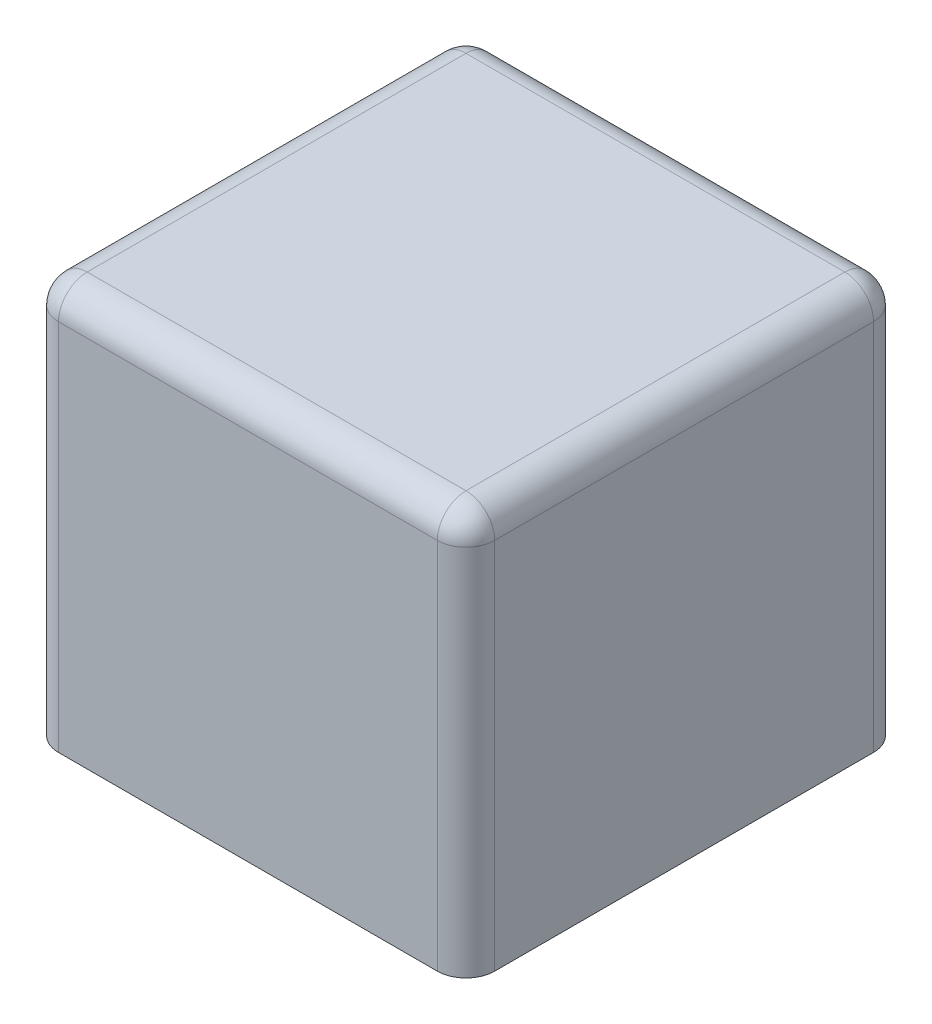
ISO-10303-21;
HEADER;
FILE_DESCRIPTION(('STEP AP214'),'2;1');
FILE_NAME('part.step','',(''),(''),'','','');
FILE_SCHEMA(('AUTOMOTIVE_DESIGN { 1 0 10303 214 1 1 1 1 }'));
ENDSEC;
DATA;
#1=APPLICATION_CONTEXT('core data for automotive mechanical design processes');
#2=APPLICATION_PROTOCOL_DEFINITION('international standard','automotive_design',2000,#1);
#3=PRODUCT_CONTEXT('',#1,'mechanical');
#4=PRODUCT('Part','Part','',(#3));
#5=PRODUCT_RELATED_PRODUCT_CATEGORY('part','',(#4));
#6=PRODUCT_DEFINITION_FORMATION('','',#4);
#7=PRODUCT_DEFINITION_CONTEXT('part definition',#1,'design');
#8=PRODUCT_DEFINITION('design','',#6,#7);
#9=PRODUCT_DEFINITION_SHAPE('','',#8);
#10=(LENGTH_UNIT() NAMED_UNIT(*) SI_UNIT(.MILLI.,.METRE.));
#11=(NAMED_UNIT(*) PLANE_ANGLE_UNIT() SI_UNIT($,.RADIAN.));
#12=(NAMED_UNIT(*) SI_UNIT($,.STERADIAN.) SOLID_ANGLE_UNIT());
#13=UNCERTAINTY_MEASURE_WITH_UNIT(LENGTH_MEASURE(1.E-05),#10,'distance_accuracy_value','');
#14=(GEOMETRIC_REPRESENTATION_CONTEXT(3) GLOBAL_UNCERTAINTY_ASSIGNED_CONTEXT((#13)) GLOBAL_UNIT_ASSIGNED_CONTEXT((#10,
#11,#12)) REPRESENTATION_CONTEXT('',''));
#15=CARTESIAN_POINT('',(0.,0.,0.));
#16=DIRECTION('',(0.,0.,1.));
#17=DIRECTION('',(1.,0.,0.));
#18=AXIS2_PLACEMENT_3D('',#15,#16,#17);
#19=CARTESIAN_POINT('',(3.8,7.,-3.8));
#20=DIRECTION('',(-1.,0.,0.));
#21=DIRECTION('',(0.,0.,1.));
#22=AXIS2_PLACEMENT_3D('',#19,#20,#21);
#23=PLANE('',#22);
#24=DIRECTION('',(0.,0.,-1.));
#25=VECTOR('',#24,1.);
#26=CARTESIAN_POINT('',(3.8,6.5,3.8));
#27=LINE('',#26,#25);
#28=CARTESIAN_POINT('',(3.8,6.5,-3.3));
#29=VERTEX_POINT('',#28);
#30=CARTESIAN_POINT('',(3.8,6.5,3.3));
#31=VERTEX_POINT('',#30);
#32=EDGE_CURVE('E261',#29,#31,#27,.F.);
#33=ORIENTED_EDGE('',*,*,#32,.T.);
#34=DIRECTION('',(0.,-1.,0.));
#35=VECTOR('',#34,1.);
#36=CARTESIAN_POINT('',(3.8,7.,3.3));
#37=LINE('',#36,#35);
#38=CARTESIAN_POINT('',(3.8,0.,3.3));
#39=VERTEX_POINT('',#38);
#40=EDGE_CURVE('E263',#31,#39,#37,.T.);
#41=ORIENTED_EDGE('',*,*,#40,.T.);
#42=DIRECTION('',(0.,0.,-1.));
#43=VECTOR('',#42,1.);
#44=CARTESIAN_POINT('',(3.8,0.,-3.8));
#45=LINE('',#44,#43);
#46=CARTESIAN_POINT('',(3.8,0.,-3.3));
#47=VERTEX_POINT('',#46);
#48=EDGE_CURVE('E198',#39,#47,#45,.T.);
#49=ORIENTED_EDGE('',*,*,#48,.T.);
#50=DIRECTION('',(0.,-1.,0.));
#51=VECTOR('',#50,1.);
#52=CARTESIAN_POINT('',(3.8,7.,-3.3));
#53=LINE('',#52,#51);
#54=EDGE_CURVE('E259',#47,#29,#53,.F.);
#55=ORIENTED_EDGE('',*,*,#54,.T.);
#56=EDGE_LOOP('',(#33,#41,#49,#55));
#57=FACE_BOUND('',#56,.T.);
#58=ADVANCED_FACE('F33',(#57),#23,.F.);
#59=CARTESIAN_POINT('',(-3.8,7.,-3.8));
#60=DIRECTION('',(0.,0.,1.));
#61=DIRECTION('',(1.,0.,0.));
#62=AXIS2_PLACEMENT_3D('',#59,#60,#61);
#63=PLANE('',#62);
#64=DIRECTION('',(-1.,0.,0.));
#65=VECTOR('',#64,1.);
#66=CARTESIAN_POINT('',(-3.8,0.,-3.8));
#67=LINE('',#66,#65);
#68=CARTESIAN_POINT('',(3.3,0.,-3.8));
#69=VERTEX_POINT('',#68);
#70=CARTESIAN_POINT('',(-3.3,0.,-3.8));
#71=VERTEX_POINT('',#70);
#72=EDGE_CURVE('E202',#69,#71,#67,.T.);
#73=ORIENTED_EDGE('',*,*,#72,.T.);
#74=DIRECTION('',(0.,-1.,0.));
#75=VECTOR('',#74,1.);
#76=CARTESIAN_POINT('',(-3.3,7.,-3.8));
#77=LINE('',#76,#75);
#78=CARTESIAN_POINT('',(-3.3,6.5,-3.8));
#79=VERTEX_POINT('',#78);
#80=EDGE_CURVE('E257',#71,#79,#77,.F.);
#81=ORIENTED_EDGE('',*,*,#80,.T.);
#82=DIRECTION('',(-1.,0.,0.));
#83=VECTOR('',#82,1.);
#84=CARTESIAN_POINT('',(3.8,6.5,-3.8));
#85=LINE('',#84,#83);
#86=CARTESIAN_POINT('',(3.3,6.5,-3.8));
#87=VERTEX_POINT('',#86);
#88=EDGE_CURVE('E254',#79,#87,#85,.F.);
#89=ORIENTED_EDGE('',*,*,#88,.T.);
#90=DIRECTION('',(0.,-1.,0.));
#91=VECTOR('',#90,1.);
#92=CARTESIAN_POINT('',(3.3,7.,-3.8));
#93=LINE('',#92,#91);
#94=EDGE_CURVE('E252',#87,#69,#93,.T.);
#95=ORIENTED_EDGE('',*,*,#94,.T.);
#96=EDGE_LOOP('',(#73,#81,#89,#95));
#97=FACE_BOUND('',#96,.T.);
#98=ADVANCED_FACE('F400',(#97),#63,.F.);
#99=CARTESIAN_POINT('',(-3.8,7.,-3.8));
#100=DIRECTION('',(1.,0.,0.));
#101=DIRECTION('',(0.,0.,-1.));
#102=AXIS2_PLACEMENT_3D('',#99,#100,#101);
#103=PLANE('',#102);
#104=DIRECTION('',(0.,0.,1.));
#105=VECTOR('',#104,1.);
#106=CARTESIAN_POINT('',(-3.8,0.,-3.8));
#107=LINE('',#106,#105);
#108=CARTESIAN_POINT('',(-3.8,0.,-3.3));
#109=VERTEX_POINT('',#108);
#110=CARTESIAN_POINT('',(-3.8,0.,3.3));
#111=VERTEX_POINT('',#110);
#112=EDGE_CURVE('E210',#109,#111,#107,.T.);
#113=ORIENTED_EDGE('',*,*,#112,.T.);
#114=DIRECTION('',(0.,-1.,0.));
#115=VECTOR('',#114,1.);
#116=CARTESIAN_POINT('',(-3.8,7.,3.3));
#117=LINE('',#116,#115);
#118=CARTESIAN_POINT('',(-3.8,6.5,3.3));
#119=VERTEX_POINT('',#118);
#120=EDGE_CURVE('E50',#111,#119,#117,.F.);
#121=ORIENTED_EDGE('',*,*,#120,.T.);
#122=DIRECTION('',(0.,0.,1.));
#123=VECTOR('',#122,1.);
#124=CARTESIAN_POINT('',(-3.8,6.5,-3.8));
#125=LINE('',#124,#123);
#126=CARTESIAN_POINT('',(-3.8,6.5,-3.3));
#127=VERTEX_POINT('',#126);
#128=EDGE_CURVE('E55',#119,#127,#125,.F.);
#129=ORIENTED_EDGE('',*,*,#128,.T.);
#130=DIRECTION('',(0.,-1.,0.));
#131=VECTOR('',#130,1.);
#132=CARTESIAN_POINT('',(-3.8,7.,-3.3));
#133=LINE('',#132,#131);
#134=EDGE_CURVE('E279',#127,#109,#133,.T.);
#135=ORIENTED_EDGE('',*,*,#134,.T.);
#136=EDGE_LOOP('',(#113,#121,#129,#135));
#137=FACE_BOUND('',#136,.T.);
#138=ADVANCED_FACE('F385',(#137),#103,.F.);
#139=CARTESIAN_POINT('',(-3.8,7.,3.8));
#140=DIRECTION('',(0.,0.,-1.));
#141=DIRECTION('',(-1.,0.,0.));
#142=AXIS2_PLACEMENT_3D('',#139,#140,#141);
#143=PLANE('',#142);
#144=DIRECTION('',(1.,0.,0.));
#145=VECTOR('',#144,1.);
#146=CARTESIAN_POINT('',(-3.8,0.,3.8));
#147=LINE('',#146,#145);
#148=CARTESIAN_POINT('',(-3.3,0.,3.8));
#149=VERTEX_POINT('',#148);
#150=CARTESIAN_POINT('',(3.3,0.,3.8));
#151=VERTEX_POINT('',#150);
#152=EDGE_CURVE('E212',#149,#151,#147,.T.);
#153=ORIENTED_EDGE('',*,*,#152,.T.);
#154=DIRECTION('',(0.,-1.,0.));
#155=VECTOR('',#154,1.);
#156=CARTESIAN_POINT('',(3.3,7.,3.8));
#157=LINE('',#156,#155);
#158=CARTESIAN_POINT('',(3.3,6.5,3.8));
#159=VERTEX_POINT('',#158);
#160=EDGE_CURVE('E277',#151,#159,#157,.F.);
#161=ORIENTED_EDGE('',*,*,#160,.T.);
#162=DIRECTION('',(1.,0.,0.));
#163=VECTOR('',#162,1.);
#164=CARTESIAN_POINT('',(-3.8,6.5,3.8));
#165=LINE('',#164,#163);
#166=CARTESIAN_POINT('',(-3.3,6.5,3.8));
#167=VERTEX_POINT('',#166);
#168=EDGE_CURVE('E275',#159,#167,#165,.F.);
#169=ORIENTED_EDGE('',*,*,#168,.T.);
#170=DIRECTION('',(0.,-1.,0.));
#171=VECTOR('',#170,1.);
#172=CARTESIAN_POINT('',(-3.3,7.,3.8));
#173=LINE('',#172,#171);
#174=EDGE_CURVE('E273',#167,#149,#173,.T.);
#175=ORIENTED_EDGE('',*,*,#174,.T.);
#176=EDGE_LOOP('',(#153,#161,#169,#175));
#177=FACE_BOUND('',#176,.T.);
#178=ADVANCED_FACE('F376',(#177),#143,.F.);
#179=CARTESIAN_POINT('',(0.,7.,0.));
#180=DIRECTION('',(0.,1.,0.));
#181=DIRECTION('',(0.,0.,1.));
#182=AXIS2_PLACEMENT_3D('',#179,#180,#181);
#183=PLANE('',#182);
#184=DIRECTION('',(0.,0.,-1.));
#185=VECTOR('',#184,1.);
#186=CARTESIAN_POINT('',(3.3,7.,-3.8));
#187=LINE('',#186,#185);
#188=CARTESIAN_POINT('',(3.3,7.,3.3));
#189=VERTEX_POINT('',#188);
#190=CARTESIAN_POINT('',(3.3,7.,-3.3));
#191=VERTEX_POINT('',#190);
#192=EDGE_CURVE('E247',#189,#191,#187,.T.);
#193=ORIENTED_EDGE('',*,*,#192,.T.);
#194=DIRECTION('',(-1.,0.,0.));
#195=VECTOR('',#194,1.);
#196=CARTESIAN_POINT('',(-3.8,7.,-3.3));
#197=LINE('',#196,#195);
#198=CARTESIAN_POINT('',(-3.3,7.,-3.3));
#199=VERTEX_POINT('',#198);
#200=EDGE_CURVE('E249',#191,#199,#197,.T.);
#201=ORIENTED_EDGE('',*,*,#200,.T.);
#202=DIRECTION('',(0.,0.,1.));
#203=VECTOR('',#202,1.);
#204=CARTESIAN_POINT('',(-3.3,7.,3.8));
#205=LINE('',#204,#203);
#206=CARTESIAN_POINT('',(-3.3,7.,3.3));
#207=VERTEX_POINT('',#206);
#208=EDGE_CURVE('E243',#199,#207,#205,.T.);
#209=ORIENTED_EDGE('',*,*,#208,.T.);
#210=DIRECTION('',(1.,0.,0.));
#211=VECTOR('',#210,1.);
#212=CARTESIAN_POINT('',(3.8,7.,3.3));
#213=LINE('',#212,#211);
#214=EDGE_CURVE('E245',#207,#189,#213,.T.);
#215=ORIENTED_EDGE('',*,*,#214,.T.);
#216=EDGE_LOOP('',(#193,#201,#209,#215));
#217=FACE_BOUND('',#216,.T.);
#218=ADVANCED_FACE('F366',(#217),#183,.T.);
#219=CARTESIAN_POINT('',(0.,0.,0.));
#220=DIRECTION('',(0.,1.,0.));
#221=DIRECTION('',(0.,0.,1.));
#222=AXIS2_PLACEMENT_3D('',#219,#220,#221);
#223=PLANE('',#222);
#224=DIRECTION('',(0.,0.,-1.));
#225=VECTOR('',#224,1.);
#226=CARTESIAN_POINT('',(-3.3,0.,3.3));
#227=LINE('',#226,#225);
#228=CARTESIAN_POINT('',(-3.3,0.,2.8));
#229=VERTEX_POINT('',#228);
#230=CARTESIAN_POINT('',(-3.3,0.,-2.8));
#231=VERTEX_POINT('',#230);
#232=EDGE_CURVE('E204',#229,#231,#227,.T.);
#233=ORIENTED_EDGE('',*,*,#232,.F.);
#234=CARTESIAN_POINT('',(-2.8,0.,2.8));
#235=DIRECTION('',(0.,1.,0.));
#236=DIRECTION('',(0.,0.,1.));
#237=AXIS2_PLACEMENT_3D('',#234,#235,#236);
#238=CIRCLE('',#237,0.5);
#239=CARTESIAN_POINT('',(-2.8,0.,3.3));
#240=VERTEX_POINT('',#239);
#241=EDGE_CURVE('E42',#229,#240,#238,.T.);
#242=ORIENTED_EDGE('',*,*,#241,.T.);
#243=DIRECTION('',(-1.,0.,0.));
#244=VECTOR('',#243,1.);
#245=CARTESIAN_POINT('',(3.3,0.,3.3));
#246=LINE('',#245,#244);
#247=CARTESIAN_POINT('',(2.8,0.,3.3));
#248=VERTEX_POINT('',#247);
#249=EDGE_CURVE('E319',#248,#240,#246,.T.);
#250=ORIENTED_EDGE('',*,*,#249,.F.);
#251=CARTESIAN_POINT('',(2.8,0.,2.8));
#252=DIRECTION('',(0.,1.,0.));
#253=DIRECTION('',(0.,0.,1.));
#254=AXIS2_PLACEMENT_3D('',#251,#252,#253);
#255=CIRCLE('',#254,0.5);
#256=CARTESIAN_POINT('',(3.3,0.,2.8));
#257=VERTEX_POINT('',#256);
#258=EDGE_CURVE('E181',#248,#257,#255,.T.);
#259=ORIENTED_EDGE('',*,*,#258,.T.);
#260=DIRECTION('',(0.,0.,1.));
#261=VECTOR('',#260,1.);
#262=CARTESIAN_POINT('',(3.3,0.,-3.3));
#263=LINE('',#262,#261);
#264=CARTESIAN_POINT('',(3.3,0.,-2.8));
#265=VERTEX_POINT('',#264);
#266=EDGE_CURVE('E186',#265,#257,#263,.T.);
#267=ORIENTED_EDGE('',*,*,#266,.F.);
#268=CARTESIAN_POINT('',(2.8,0.,-2.8));
#269=DIRECTION('',(0.,1.,0.));
#270=DIRECTION('',(0.,0.,1.));
#271=AXIS2_PLACEMENT_3D('',#268,#269,#270);
#272=CIRCLE('',#271,0.5);
#273=CARTESIAN_POINT('',(2.8,0.,-3.3));
#274=VERTEX_POINT('',#273);
#275=EDGE_CURVE('E171',#265,#274,#272,.T.);
#276=ORIENTED_EDGE('',*,*,#275,.T.);
#277=DIRECTION('',(1.,0.,0.));
#278=VECTOR('',#277,1.);
#279=CARTESIAN_POINT('',(-3.3,0.,-3.3));
#280=LINE('',#279,#278);
#281=CARTESIAN_POINT('',(-2.8,0.,-3.3));
#282=VERTEX_POINT('',#281);
#283=EDGE_CURVE('E199',#282,#274,#280,.T.);
#284=ORIENTED_EDGE('',*,*,#283,.F.);
#285=CARTESIAN_POINT('',(-2.8,0.,-2.8));
#286=DIRECTION('',(0.,1.,0.));
#287=DIRECTION('',(0.,0.,1.));
#288=AXIS2_PLACEMENT_3D('',#285,#286,#287);
#289=CIRCLE('',#288,0.5);
#290=EDGE_CURVE('E11',#282,#231,#289,.T.);
#291=ORIENTED_EDGE('',*,*,#290,.T.);
#292=EDGE_LOOP('',(#233,#242,#250,#259,#267,#276,#284,#291));
#293=FACE_BOUND('',#292,.T.);
#294=ORIENTED_EDGE('',*,*,#48,.F.);
#295=CARTESIAN_POINT('',(3.3,0.,3.3));
#296=DIRECTION('',(0.,1.,0.));
#297=DIRECTION('',(0.,0.,1.));
#298=AXIS2_PLACEMENT_3D('',#295,#296,#297);
#299=CIRCLE('',#298,0.5);
#300=EDGE_CURVE('E271',#39,#151,#299,.F.);
#301=ORIENTED_EDGE('',*,*,#300,.T.);
#302=ORIENTED_EDGE('',*,*,#152,.F.);
#303=CARTESIAN_POINT('',(-3.3,0.,3.3));
#304=DIRECTION('',(0.,1.,0.));
#305=DIRECTION('',(0.,0.,1.));
#306=AXIS2_PLACEMENT_3D('',#303,#304,#305);
#307=CIRCLE('',#306,0.5);
#308=EDGE_CURVE('E269',#149,#111,#307,.F.);
#309=ORIENTED_EDGE('',*,*,#308,.T.);
#310=ORIENTED_EDGE('',*,*,#112,.F.);
#311=CARTESIAN_POINT('',(-3.3,0.,-3.3));
#312=DIRECTION('',(0.,1.,0.));
#313=DIRECTION('',(0.,0.,1.));
#314=AXIS2_PLACEMENT_3D('',#311,#312,#313);
#315=CIRCLE('',#314,0.5);
#316=EDGE_CURVE('E267',#109,#71,#315,.F.);
#317=ORIENTED_EDGE('',*,*,#316,.T.);
#318=ORIENTED_EDGE('',*,*,#72,.F.);
#319=CARTESIAN_POINT('',(3.3,0.,-3.3));
#320=DIRECTION('',(0.,1.,0.));
#321=DIRECTION('',(0.,0.,1.));
#322=AXIS2_PLACEMENT_3D('',#319,#320,#321);
#323=CIRCLE('',#322,0.5);
#324=EDGE_CURVE('E265',#69,#47,#323,.F.);
#325=ORIENTED_EDGE('',*,*,#324,.T.);
#326=EDGE_LOOP('',(#294,#301,#302,#309,#310,#317,#318,#325));
#327=FACE_BOUND('',#326,.T.);
#328=ADVANCED_FACE('F194',(#293,#327),#223,.F.);
#329=CARTESIAN_POINT('',(3.3,6.5,3.3));
#330=DIRECTION('',(0.,0.,1.));
#331=DIRECTION('',(1.,0.,0.));
#332=AXIS2_PLACEMENT_3D('',#329,#330,#331);
#333=PLANE('',#332);
#334=DIRECTION('',(-1.,0.,0.));
#335=VECTOR('',#334,1.);
#336=CARTESIAN_POINT('',(3.3,6.,3.3));
#337=LINE('',#336,#335);
#338=CARTESIAN_POINT('',(-2.8,6.,3.3));
#339=VERTEX_POINT('',#338);
#340=CARTESIAN_POINT('',(2.8,6.,3.3));
#341=VERTEX_POINT('',#340);
#342=EDGE_CURVE('E233',#339,#341,#337,.F.);
#343=ORIENTED_EDGE('',*,*,#342,.T.);
#344=DIRECTION('',(0.,-1.,0.));
#345=VECTOR('',#344,1.);
#346=CARTESIAN_POINT('',(2.8,0.,3.3));
#347=LINE('',#346,#345);
#348=EDGE_CURVE('E235',#341,#248,#347,.T.);
#349=ORIENTED_EDGE('',*,*,#348,.T.);
#350=ORIENTED_EDGE('',*,*,#249,.T.);
#351=DIRECTION('',(0.,-1.,0.));
#352=VECTOR('',#351,1.);
#353=CARTESIAN_POINT('',(-2.8,6.5,3.3));
#354=LINE('',#353,#352);
#355=EDGE_CURVE('E231',#240,#339,#354,.F.);
#356=ORIENTED_EDGE('',*,*,#355,.T.);
#357=EDGE_LOOP('',(#343,#349,#350,#356));
#358=FACE_BOUND('',#357,.T.);
#359=ADVANCED_FACE('F653',(#358),#333,.F.);
#360=CARTESIAN_POINT('',(3.3,6.5,-3.3));
#361=DIRECTION('',(1.,0.,0.));
#362=DIRECTION('',(0.,0.,-1.));
#363=AXIS2_PLACEMENT_3D('',#360,#361,#362);
#364=PLANE('',#363);
#365=DIRECTION('',(0.,0.,1.));
#366=VECTOR('',#365,1.);
#367=CARTESIAN_POINT('',(3.3,6.,-3.3));
#368=LINE('',#367,#366);
#369=CARTESIAN_POINT('',(3.3,6.,2.8));
#370=VERTEX_POINT('',#369);
#371=CARTESIAN_POINT('',(3.3,6.,-2.8));
#372=VERTEX_POINT('',#371);
#373=EDGE_CURVE('E189',#370,#372,#368,.F.);
#374=ORIENTED_EDGE('',*,*,#373,.T.);
#375=DIRECTION('',(0.,-1.,0.));
#376=VECTOR('',#375,1.);
#377=CARTESIAN_POINT('',(3.3,0.,-2.8));
#378=LINE('',#377,#376);
#379=EDGE_CURVE('E175',#372,#265,#378,.T.);
#380=ORIENTED_EDGE('',*,*,#379,.T.);
#381=ORIENTED_EDGE('',*,*,#266,.T.);
#382=DIRECTION('',(0.,-1.,0.));
#383=VECTOR('',#382,1.);
#384=CARTESIAN_POINT('',(3.3,6.5,2.8));
#385=LINE('',#384,#383);
#386=EDGE_CURVE('E215',#257,#370,#385,.F.);
#387=ORIENTED_EDGE('',*,*,#386,.T.);
#388=EDGE_LOOP('',(#374,#380,#381,#387));
#389=FACE_BOUND('',#388,.T.);
#390=ADVANCED_FACE('F185',(#389),#364,.F.);
#391=CARTESIAN_POINT('',(-3.3,6.5,-3.3));
#392=DIRECTION('',(0.,0.,-1.));
#393=DIRECTION('',(-1.,0.,0.));
#394=AXIS2_PLACEMENT_3D('',#391,#392,#393);
#395=PLANE('',#394);
#396=ORIENTED_EDGE('',*,*,#283,.T.);
#397=DIRECTION('',(0.,-1.,0.));
#398=VECTOR('',#397,1.);
#399=CARTESIAN_POINT('',(2.8,6.5,-3.3));
#400=LINE('',#399,#398);
#401=CARTESIAN_POINT('',(2.8,6.,-3.3));
#402=VERTEX_POINT('',#401);
#403=EDGE_CURVE('E176',#274,#402,#400,.F.);
#404=ORIENTED_EDGE('',*,*,#403,.T.);
#405=DIRECTION('',(1.,0.,0.));
#406=VECTOR('',#405,1.);
#407=CARTESIAN_POINT('',(-3.3,6.,-3.3));
#408=LINE('',#407,#406);
#409=CARTESIAN_POINT('',(-2.8,6.,-3.3));
#410=VERTEX_POINT('',#409);
#411=EDGE_CURVE('E219',#402,#410,#408,.F.);
#412=ORIENTED_EDGE('',*,*,#411,.T.);
#413=DIRECTION('',(0.,-1.,0.));
#414=VECTOR('',#413,1.);
#415=CARTESIAN_POINT('',(-2.8,0.,-3.3));
#416=LINE('',#415,#414);
#417=EDGE_CURVE('E191',#410,#282,#416,.T.);
#418=ORIENTED_EDGE('',*,*,#417,.T.);
#419=EDGE_LOOP('',(#396,#404,#412,#418));
#420=FACE_BOUND('',#419,.T.);
#421=ADVANCED_FACE('F636',(#420),#395,.F.);
#422=CARTESIAN_POINT('',(-3.3,6.5,3.3));
#423=DIRECTION('',(-1.,0.,0.));
#424=DIRECTION('',(0.,0.,1.));
#425=AXIS2_PLACEMENT_3D('',#422,#423,#424);
#426=PLANE('',#425);
#427=DIRECTION('',(0.,0.,-1.));
#428=VECTOR('',#427,1.);
#429=CARTESIAN_POINT('',(-3.3,6.,3.3));
#430=LINE('',#429,#428);
#431=CARTESIAN_POINT('',(-3.3,6.,-2.8));
#432=VERTEX_POINT('',#431);
#433=CARTESIAN_POINT('',(-3.3,6.,2.8));
#434=VERTEX_POINT('',#433);
#435=EDGE_CURVE('E239',#432,#434,#430,.F.);
#436=ORIENTED_EDGE('',*,*,#435,.T.);
#437=DIRECTION('',(0.,-1.,0.));
#438=VECTOR('',#437,1.);
#439=CARTESIAN_POINT('',(-3.3,0.,2.8));
#440=LINE('',#439,#438);
#441=EDGE_CURVE('E241',#434,#229,#440,.T.);
#442=ORIENTED_EDGE('',*,*,#441,.T.);
#443=ORIENTED_EDGE('',*,*,#232,.T.);
#444=DIRECTION('',(0.,-1.,0.));
#445=VECTOR('',#444,1.);
#446=CARTESIAN_POINT('',(-3.3,6.5,-2.8));
#447=LINE('',#446,#445);
#448=EDGE_CURVE('E237',#231,#432,#447,.F.);
#449=ORIENTED_EDGE('',*,*,#448,.T.);
#450=EDGE_LOOP('',(#436,#442,#443,#449));
#451=FACE_BOUND('',#450,.T.);
#452=ADVANCED_FACE('F627',(#451),#426,.F.);
#453=CARTESIAN_POINT('',(0.,6.5,0.));
#454=DIRECTION('',(0.,-1.,0.));
#455=DIRECTION('',(0.,0.,-1.));
#456=AXIS2_PLACEMENT_3D('',#453,#454,#455);
#457=PLANE('',#456);
#458=DIRECTION('',(1.,0.,0.));
#459=VECTOR('',#458,1.);
#460=CARTESIAN_POINT('',(0.,6.5,-2.8));
#461=LINE('',#460,#459);
#462=CARTESIAN_POINT('',(-2.8,6.5,-2.8));
#463=VERTEX_POINT('',#462);
#464=CARTESIAN_POINT('',(2.8,6.5,-2.8));
#465=VERTEX_POINT('',#464);
#466=EDGE_CURVE('E222',#463,#465,#461,.T.);
#467=ORIENTED_EDGE('',*,*,#466,.T.);
#468=DIRECTION('',(0.,0.,1.));
#469=VECTOR('',#468,1.);
#470=CARTESIAN_POINT('',(2.8,6.5,0.));
#471=LINE('',#470,#469);
#472=CARTESIAN_POINT('',(2.8,6.5,2.8));
#473=VERTEX_POINT('',#472);
#474=EDGE_CURVE('E228',#465,#473,#471,.T.);
#475=ORIENTED_EDGE('',*,*,#474,.T.);
#476=DIRECTION('',(-1.,0.,0.));
#477=VECTOR('',#476,1.);
#478=CARTESIAN_POINT('',(0.,6.5,2.8));
#479=LINE('',#478,#477);
#480=CARTESIAN_POINT('',(-2.8,6.5,2.8));
#481=VERTEX_POINT('',#480);
#482=EDGE_CURVE('E226',#473,#481,#479,.T.);
#483=ORIENTED_EDGE('',*,*,#482,.T.);
#484=DIRECTION('',(0.,0.,-1.));
#485=VECTOR('',#484,1.);
#486=CARTESIAN_POINT('',(-2.8,6.5,0.));
#487=LINE('',#486,#485);
#488=EDGE_CURVE('E224',#481,#463,#487,.T.);
#489=ORIENTED_EDGE('',*,*,#488,.T.);
#490=EDGE_LOOP('',(#467,#475,#483,#489));
#491=FACE_BOUND('',#490,.T.);
#492=ADVANCED_FACE('F466',(#491),#457,.T.);
#493=CARTESIAN_POINT('',(-2.8,6.5,2.8));
#494=DIRECTION('',(0.,1.,0.));
#495=DIRECTION('',(0.,0.,1.));
#496=AXIS2_PLACEMENT_3D('',#493,#494,#495);
#497=CYLINDRICAL_SURFACE('',#496,0.5);
#498=CARTESIAN_POINT('',(-2.8,6.,2.8));
#499=DIRECTION('',(0.,-1.,0.));
#500=DIRECTION('',(0.,0.,-1.));
#501=AXIS2_PLACEMENT_3D('',#498,#499,#500);
#502=CIRCLE('',#501,0.5);
#503=EDGE_CURVE('E316',#339,#434,#502,.T.);
#504=ORIENTED_EDGE('',*,*,#503,.F.);
#505=ORIENTED_EDGE('',*,*,#355,.F.);
#506=ORIENTED_EDGE('',*,*,#241,.F.);
#507=ORIENTED_EDGE('',*,*,#441,.F.);
#508=EDGE_LOOP('',(#504,#505,#506,#507));
#509=FACE_BOUND('',#508,.T.);
#510=ADVANCED_FACE('F462',(#509),#497,.F.);
#511=CARTESIAN_POINT('',(-2.8,6.,2.8));
#512=DIRECTION('',(0.,0.,1.));
#513=DIRECTION('',(1.,0.,0.));
#514=AXIS2_PLACEMENT_3D('',#511,#512,#513);
#515=SPHERICAL_SURFACE('',#514,0.5);
#516=CARTESIAN_POINT('',(-2.8,6.,2.8));
#517=DIRECTION('',(1.,0.,0.));
#518=DIRECTION('',(0.,0.,-1.));
#519=AXIS2_PLACEMENT_3D('',#516,#517,#518);
#520=CIRCLE('',#519,0.5);
#521=EDGE_CURVE('E310',#339,#481,#520,.F.);
#522=ORIENTED_EDGE('',*,*,#521,.F.);
#523=ORIENTED_EDGE('',*,*,#503,.T.);
#524=CARTESIAN_POINT('',(-2.8,6.,2.8));
#525=DIRECTION('',(0.,0.,-1.));
#526=DIRECTION('',(-1.,0.,0.));
#527=AXIS2_PLACEMENT_3D('',#524,#525,#526);
#528=CIRCLE('',#527,0.5);
#529=EDGE_CURVE('E313',#481,#434,#528,.F.);
#530=ORIENTED_EDGE('',*,*,#529,.F.);
#531=EDGE_LOOP('',(#522,#523,#530));
#532=FACE_BOUND('',#531,.T.);
#533=ADVANCED_FACE('F458',(#532),#515,.F.);
#534=CARTESIAN_POINT('',(-2.8,6.5,-2.8));
#535=DIRECTION('',(0.,1.,0.));
#536=DIRECTION('',(0.,0.,1.));
#537=AXIS2_PLACEMENT_3D('',#534,#535,#536);
#538=CYLINDRICAL_SURFACE('',#537,0.5);
#539=ORIENTED_EDGE('',*,*,#290,.F.);
#540=ORIENTED_EDGE('',*,*,#417,.F.);
#541=CARTESIAN_POINT('',(-2.8,6.,-2.8));
#542=DIRECTION('',(0.,-1.,0.));
#543=DIRECTION('',(0.,0.,-1.));
#544=AXIS2_PLACEMENT_3D('',#541,#542,#543);
#545=CIRCLE('',#544,0.5);
#546=EDGE_CURVE('E307',#432,#410,#545,.T.);
#547=ORIENTED_EDGE('',*,*,#546,.F.);
#548=ORIENTED_EDGE('',*,*,#448,.F.);
#549=EDGE_LOOP('',(#539,#540,#547,#548));
#550=FACE_BOUND('',#549,.T.);
#551=ADVANCED_FACE('F454',(#550),#538,.F.);
#552=CARTESIAN_POINT('',(-2.8,6.,0.));
#553=DIRECTION('',(0.,0.,-1.));
#554=DIRECTION('',(-1.,0.,0.));
#555=AXIS2_PLACEMENT_3D('',#552,#553,#554);
#556=CYLINDRICAL_SURFACE('',#555,0.5);
#557=ORIENTED_EDGE('',*,*,#529,.T.);
#558=ORIENTED_EDGE('',*,*,#435,.F.);
#559=CARTESIAN_POINT('',(-2.8,6.,-2.8));
#560=DIRECTION('',(0.,0.,1.));
#561=DIRECTION('',(1.,0.,0.));
#562=AXIS2_PLACEMENT_3D('',#559,#560,#561);
#563=CIRCLE('',#562,0.5);
#564=EDGE_CURVE('E304',#463,#432,#563,.T.);
#565=ORIENTED_EDGE('',*,*,#564,.F.);
#566=ORIENTED_EDGE('',*,*,#488,.F.);
#567=EDGE_LOOP('',(#557,#558,#565,#566));
#568=FACE_BOUND('',#567,.T.);
#569=ADVANCED_FACE('F450',(#568),#556,.F.);
#570=CARTESIAN_POINT('',(0.,6.,2.8));
#571=DIRECTION('',(-1.,0.,0.));
#572=DIRECTION('',(0.,0.,1.));
#573=AXIS2_PLACEMENT_3D('',#570,#571,#572);
#574=CYLINDRICAL_SURFACE('',#573,0.5);
#575=ORIENTED_EDGE('',*,*,#521,.T.);
#576=ORIENTED_EDGE('',*,*,#482,.F.);
#577=CARTESIAN_POINT('',(2.8,6.,2.8));
#578=DIRECTION('',(-1.,0.,0.));
#579=DIRECTION('',(0.,0.,1.));
#580=AXIS2_PLACEMENT_3D('',#577,#578,#579);
#581=CIRCLE('',#580,0.5);
#582=EDGE_CURVE('E301',#341,#473,#581,.T.);
#583=ORIENTED_EDGE('',*,*,#582,.F.);
#584=ORIENTED_EDGE('',*,*,#342,.F.);
#585=EDGE_LOOP('',(#575,#576,#583,#584));
#586=FACE_BOUND('',#585,.T.);
#587=ADVANCED_FACE('F446',(#586),#574,.F.);
#588=CARTESIAN_POINT('',(2.8,6.5,2.8));
#589=DIRECTION('',(0.,1.,0.));
#590=DIRECTION('',(0.,0.,1.));
#591=AXIS2_PLACEMENT_3D('',#588,#589,#590);
#592=CYLINDRICAL_SURFACE('',#591,0.5);
#593=ORIENTED_EDGE('',*,*,#258,.F.);
#594=ORIENTED_EDGE('',*,*,#348,.F.);
#595=CARTESIAN_POINT('',(2.8,6.,2.8));
#596=DIRECTION('',(0.,-1.,0.));
#597=DIRECTION('',(0.,0.,-1.));
#598=AXIS2_PLACEMENT_3D('',#595,#596,#597);
#599=CIRCLE('',#598,0.5);
#600=EDGE_CURVE('E298',#370,#341,#599,.T.);
#601=ORIENTED_EDGE('',*,*,#600,.F.);
#602=ORIENTED_EDGE('',*,*,#386,.F.);
#603=EDGE_LOOP('',(#593,#594,#601,#602));
#604=FACE_BOUND('',#603,.T.);
#605=ADVANCED_FACE('F442',(#604),#592,.F.);
#606=CARTESIAN_POINT('',(-2.8,6.,-2.8));
#607=DIRECTION('',(0.,0.,1.));
#608=DIRECTION('',(1.,0.,0.));
#609=AXIS2_PLACEMENT_3D('',#606,#607,#608);
#610=SPHERICAL_SURFACE('',#609,0.5);
#611=ORIENTED_EDGE('',*,*,#564,.T.);
#612=ORIENTED_EDGE('',*,*,#546,.T.);
#613=CARTESIAN_POINT('',(-2.8,6.,-2.8));
#614=DIRECTION('',(1.,0.,0.));
#615=DIRECTION('',(0.,0.,-1.));
#616=AXIS2_PLACEMENT_3D('',#613,#614,#615);
#617=CIRCLE('',#616,0.5);
#618=EDGE_CURVE('E295',#463,#410,#617,.F.);
#619=ORIENTED_EDGE('',*,*,#618,.F.);
#620=EDGE_LOOP('',(#611,#612,#619));
#621=FACE_BOUND('',#620,.T.);
#622=ADVANCED_FACE('F438',(#621),#610,.F.);
#623=CARTESIAN_POINT('',(2.8,6.,2.8));
#624=DIRECTION('',(0.,0.,1.));
#625=DIRECTION('',(1.,0.,0.));
#626=AXIS2_PLACEMENT_3D('',#623,#624,#625);
#627=SPHERICAL_SURFACE('',#626,0.5);
#628=ORIENTED_EDGE('',*,*,#600,.T.);
#629=ORIENTED_EDGE('',*,*,#582,.T.);
#630=CARTESIAN_POINT('',(2.8,6.,2.8));
#631=DIRECTION('',(0.,0.,-1.));
#632=DIRECTION('',(-1.,0.,0.));
#633=AXIS2_PLACEMENT_3D('',#630,#631,#632);
#634=CIRCLE('',#633,0.5);
#635=EDGE_CURVE('E293',#370,#473,#634,.F.);
#636=ORIENTED_EDGE('',*,*,#635,.F.);
#637=EDGE_LOOP('',(#628,#629,#636));
#638=FACE_BOUND('',#637,.T.);
#639=ADVANCED_FACE('F434',(#638),#627,.F.);
#640=CARTESIAN_POINT('',(0.,6.,-2.8));
#641=DIRECTION('',(1.,0.,0.));
#642=DIRECTION('',(0.,0.,-1.));
#643=AXIS2_PLACEMENT_3D('',#640,#641,#642);
#644=CYLINDRICAL_SURFACE('',#643,0.5);
#645=ORIENTED_EDGE('',*,*,#618,.T.);
#646=ORIENTED_EDGE('',*,*,#411,.F.);
#647=CARTESIAN_POINT('',(2.8,6.,-2.8));
#648=DIRECTION('',(-1.,0.,0.));
#649=DIRECTION('',(0.,0.,1.));
#650=AXIS2_PLACEMENT_3D('',#647,#648,#649);
#651=CIRCLE('',#650,0.5);
#652=EDGE_CURVE('E290',#465,#402,#651,.T.);
#653=ORIENTED_EDGE('',*,*,#652,.F.);
#654=ORIENTED_EDGE('',*,*,#466,.F.);
#655=EDGE_LOOP('',(#645,#646,#653,#654));
#656=FACE_BOUND('',#655,.T.);
#657=ADVANCED_FACE('F430',(#656),#644,.F.);
#658=CARTESIAN_POINT('',(2.8,6.,0.));
#659=DIRECTION('',(0.,0.,1.));
#660=DIRECTION('',(1.,0.,0.));
#661=AXIS2_PLACEMENT_3D('',#658,#659,#660);
#662=CYLINDRICAL_SURFACE('',#661,0.5);
#663=ORIENTED_EDGE('',*,*,#635,.T.);
#664=ORIENTED_EDGE('',*,*,#474,.F.);
#665=CARTESIAN_POINT('',(2.8,6.,-2.8));
#666=DIRECTION('',(0.,0.,1.));
#667=DIRECTION('',(1.,0.,0.));
#668=AXIS2_PLACEMENT_3D('',#665,#666,#667);
#669=CIRCLE('',#668,0.5);
#670=EDGE_CURVE('E287',#372,#465,#669,.T.);
#671=ORIENTED_EDGE('',*,*,#670,.F.);
#672=ORIENTED_EDGE('',*,*,#373,.F.);
#673=EDGE_LOOP('',(#663,#664,#671,#672));
#674=FACE_BOUND('',#673,.T.);
#675=ADVANCED_FACE('F426',(#674),#662,.F.);
#676=CARTESIAN_POINT('',(2.8,6.,-2.8));
#677=DIRECTION('',(0.,0.,1.));
#678=DIRECTION('',(1.,0.,0.));
#679=AXIS2_PLACEMENT_3D('',#676,#677,#678);
#680=SPHERICAL_SURFACE('',#679,0.5);
#681=ORIENTED_EDGE('',*,*,#670,.T.);
#682=ORIENTED_EDGE('',*,*,#652,.T.);
#683=CARTESIAN_POINT('',(2.8,6.,-2.8));
#684=DIRECTION('',(0.,-1.,0.));
#685=DIRECTION('',(0.,0.,-1.));
#686=AXIS2_PLACEMENT_3D('',#683,#684,#685);
#687=CIRCLE('',#686,0.5);
#688=EDGE_CURVE('E285',#372,#402,#687,.F.);
#689=ORIENTED_EDGE('',*,*,#688,.F.);
#690=EDGE_LOOP('',(#681,#682,#689));
#691=FACE_BOUND('',#690,.T.);
#692=ADVANCED_FACE('F414',(#691),#680,.F.);
#693=CARTESIAN_POINT('',(2.8,6.5,-2.8));
#694=DIRECTION('',(0.,1.,0.));
#695=DIRECTION('',(0.,0.,1.));
#696=AXIS2_PLACEMENT_3D('',#693,#694,#695);
#697=CYLINDRICAL_SURFACE('',#696,0.5);
#698=ORIENTED_EDGE('',*,*,#688,.T.);
#699=ORIENTED_EDGE('',*,*,#403,.F.);
#700=ORIENTED_EDGE('',*,*,#275,.F.);
#701=ORIENTED_EDGE('',*,*,#379,.F.);
#702=EDGE_LOOP('',(#698,#699,#700,#701));
#703=FACE_BOUND('',#702,.T.);
#704=ADVANCED_FACE('F174',(#703),#697,.F.);
#705=CARTESIAN_POINT('',(3.3,7.,3.3));
#706=DIRECTION('',(0.,-1.,0.));
#707=DIRECTION('',(0.,0.,-1.));
#708=AXIS2_PLACEMENT_3D('',#705,#706,#707);
#709=CYLINDRICAL_SURFACE('',#708,0.5);
#710=ORIENTED_EDGE('',*,*,#300,.F.);
#711=ORIENTED_EDGE('',*,*,#40,.F.);
#712=CARTESIAN_POINT('',(3.3,6.5,3.3));
#713=DIRECTION('',(0.,1.,0.));
#714=DIRECTION('',(0.,0.,1.));
#715=AXIS2_PLACEMENT_3D('',#712,#713,#714);
#716=CIRCLE('',#715,0.5);
#717=EDGE_CURVE('E37',#159,#31,#716,.T.);
#718=ORIENTED_EDGE('',*,*,#717,.F.);
#719=ORIENTED_EDGE('',*,*,#160,.F.);
#720=EDGE_LOOP('',(#710,#711,#718,#719));
#721=FACE_BOUND('',#720,.T.);
#722=ADVANCED_FACE('F35',(#721),#709,.T.);
#723=CARTESIAN_POINT('',(0.,6.5,3.3));
#724=DIRECTION('',(-1.,0.,0.));
#725=DIRECTION('',(0.,0.,1.));
#726=AXIS2_PLACEMENT_3D('',#723,#724,#725);
#727=CYLINDRICAL_SURFACE('',#726,0.5);
#728=CARTESIAN_POINT('',(-3.3,6.5,3.3));
#729=DIRECTION('',(-1.,0.,0.));
#730=DIRECTION('',(0.,0.,1.));
#731=AXIS2_PLACEMENT_3D('',#728,#729,#730);
#732=CIRCLE('',#731,0.5);
#733=EDGE_CURVE('E345',#167,#207,#732,.T.);
#734=ORIENTED_EDGE('',*,*,#733,.F.);
#735=ORIENTED_EDGE('',*,*,#168,.F.);
#736=CARTESIAN_POINT('',(3.3,6.5,3.3));
#737=DIRECTION('',(1.,0.,0.));
#738=DIRECTION('',(0.,0.,-1.));
#739=AXIS2_PLACEMENT_3D('',#736,#737,#738);
#740=CIRCLE('',#739,0.5);
#741=EDGE_CURVE('E347',#189,#159,#740,.T.);
#742=ORIENTED_EDGE('',*,*,#741,.F.);
#743=ORIENTED_EDGE('',*,*,#214,.F.);
#744=EDGE_LOOP('',(#734,#735,#742,#743));
#745=FACE_BOUND('',#744,.T.);
#746=ADVANCED_FACE('F373',(#745),#727,.T.);
#747=CARTESIAN_POINT('',(-3.3,7.,3.3));
#748=DIRECTION('',(0.,-1.,0.));
#749=DIRECTION('',(0.,0.,-1.));
#750=AXIS2_PLACEMENT_3D('',#747,#748,#749);
#751=CYLINDRICAL_SURFACE('',#750,0.5);
#752=ORIENTED_EDGE('',*,*,#308,.F.);
#753=ORIENTED_EDGE('',*,*,#174,.F.);
#754=CARTESIAN_POINT('',(-3.3,6.5,3.3));
#755=DIRECTION('',(0.,1.,0.));
#756=DIRECTION('',(0.,0.,1.));
#757=AXIS2_PLACEMENT_3D('',#754,#755,#756);
#758=CIRCLE('',#757,0.5);
#759=EDGE_CURVE('E342',#119,#167,#758,.T.);
#760=ORIENTED_EDGE('',*,*,#759,.F.);
#761=ORIENTED_EDGE('',*,*,#120,.F.);
#762=EDGE_LOOP('',(#752,#753,#760,#761));
#763=FACE_BOUND('',#762,.T.);
#764=ADVANCED_FACE('F380',(#763),#751,.T.);
#765=CARTESIAN_POINT('',(3.3,6.5,3.3));
#766=DIRECTION('',(0.,0.,1.));
#767=DIRECTION('',(1.,0.,0.));
#768=AXIS2_PLACEMENT_3D('',#765,#766,#767);
#769=SPHERICAL_SURFACE('',#768,0.5);
#770=ORIENTED_EDGE('',*,*,#741,.T.);
#771=ORIENTED_EDGE('',*,*,#717,.T.);
#772=CARTESIAN_POINT('',(3.3,6.5,3.3));
#773=DIRECTION('',(0.,0.,1.));
#774=DIRECTION('',(1.,0.,0.));
#775=AXIS2_PLACEMENT_3D('',#772,#773,#774);
#776=CIRCLE('',#775,0.5);
#777=EDGE_CURVE('E339',#189,#31,#776,.F.);
#778=ORIENTED_EDGE('',*,*,#777,.F.);
#779=EDGE_LOOP('',(#770,#771,#778));
#780=FACE_BOUND('',#779,.T.);
#781=ADVANCED_FACE('F354',(#780),#769,.T.);
#782=CARTESIAN_POINT('',(-3.3,6.5,3.3));
#783=DIRECTION('',(0.,0.,1.));
#784=DIRECTION('',(1.,0.,0.));
#785=AXIS2_PLACEMENT_3D('',#782,#783,#784);
#786=SPHERICAL_SURFACE('',#785,0.5);
#787=ORIENTED_EDGE('',*,*,#759,.T.);
#788=ORIENTED_EDGE('',*,*,#733,.T.);
#789=CARTESIAN_POINT('',(-3.3,6.5,3.3));
#790=DIRECTION('',(0.,0.,1.));
#791=DIRECTION('',(1.,0.,0.));
#792=AXIS2_PLACEMENT_3D('',#789,#790,#791);
#793=CIRCLE('',#792,0.5);
#794=EDGE_CURVE('E336',#119,#207,#793,.F.);
#795=ORIENTED_EDGE('',*,*,#794,.F.);
#796=EDGE_LOOP('',(#787,#788,#795));
#797=FACE_BOUND('',#796,.T.);
#798=ADVANCED_FACE('F484',(#797),#786,.T.);
#799=CARTESIAN_POINT('',(3.3,7.,-3.3));
#800=DIRECTION('',(0.,-1.,0.));
#801=DIRECTION('',(0.,0.,-1.));
#802=AXIS2_PLACEMENT_3D('',#799,#800,#801);
#803=CYLINDRICAL_SURFACE('',#802,0.5);
#804=ORIENTED_EDGE('',*,*,#324,.F.);
#805=ORIENTED_EDGE('',*,*,#94,.F.);
#806=CARTESIAN_POINT('',(3.3,6.5,-3.3));
#807=DIRECTION('',(0.,1.,0.));
#808=DIRECTION('',(0.,0.,1.));
#809=AXIS2_PLACEMENT_3D('',#806,#807,#808);
#810=CIRCLE('',#809,0.5);
#811=EDGE_CURVE('E333',#29,#87,#810,.T.);
#812=ORIENTED_EDGE('',*,*,#811,.F.);
#813=ORIENTED_EDGE('',*,*,#54,.F.);
#814=EDGE_LOOP('',(#804,#805,#812,#813));
#815=FACE_BOUND('',#814,.T.);
#816=ADVANCED_FACE('F406',(#815),#803,.T.);
#817=CARTESIAN_POINT('',(3.3,6.5,0.));
#818=DIRECTION('',(0.,0.,1.));
#819=DIRECTION('',(1.,0.,0.));
#820=AXIS2_PLACEMENT_3D('',#817,#818,#819);
#821=CYLINDRICAL_SURFACE('',#820,0.5);
#822=ORIENTED_EDGE('',*,*,#777,.T.);
#823=ORIENTED_EDGE('',*,*,#32,.F.);
#824=CARTESIAN_POINT('',(3.3,6.5,-3.3));
#825=DIRECTION('',(0.,0.,-1.));
#826=DIRECTION('',(-1.,0.,0.));
#827=AXIS2_PLACEMENT_3D('',#824,#825,#826);
#828=CIRCLE('',#827,0.5);
#829=EDGE_CURVE('E330',#191,#29,#828,.T.);
#830=ORIENTED_EDGE('',*,*,#829,.F.);
#831=ORIENTED_EDGE('',*,*,#192,.F.);
#832=EDGE_LOOP('',(#822,#823,#830,#831));
#833=FACE_BOUND('',#832,.T.);
#834=ADVANCED_FACE('F361',(#833),#821,.T.);
#835=CARTESIAN_POINT('',(-3.3,6.5,0.));
#836=DIRECTION('',(0.,0.,-1.));
#837=DIRECTION('',(-1.,0.,0.));
#838=AXIS2_PLACEMENT_3D('',#835,#836,#837);
#839=CYLINDRICAL_SURFACE('',#838,0.5);
#840=ORIENTED_EDGE('',*,*,#794,.T.);
#841=ORIENTED_EDGE('',*,*,#208,.F.);
#842=CARTESIAN_POINT('',(-3.3,6.5,-3.3));
#843=DIRECTION('',(0.,0.,-1.));
#844=DIRECTION('',(-1.,0.,0.));
#845=AXIS2_PLACEMENT_3D('',#842,#843,#844);
#846=CIRCLE('',#845,0.5);
#847=EDGE_CURVE('E327',#127,#199,#846,.T.);
#848=ORIENTED_EDGE('',*,*,#847,.F.);
#849=ORIENTED_EDGE('',*,*,#128,.F.);
#850=EDGE_LOOP('',(#840,#841,#848,#849));
#851=FACE_BOUND('',#850,.T.);
#852=ADVANCED_FACE('F393',(#851),#839,.T.);
#853=CARTESIAN_POINT('',(-3.3,7.,-3.3));
#854=DIRECTION('',(0.,-1.,0.));
#855=DIRECTION('',(0.,0.,-1.));
#856=AXIS2_PLACEMENT_3D('',#853,#854,#855);
#857=CYLINDRICAL_SURFACE('',#856,0.5);
#858=ORIENTED_EDGE('',*,*,#316,.F.);
#859=ORIENTED_EDGE('',*,*,#134,.F.);
#860=CARTESIAN_POINT('',(-3.3,6.5,-3.3));
#861=DIRECTION('',(0.,1.,0.));
#862=DIRECTION('',(0.,0.,1.));
#863=AXIS2_PLACEMENT_3D('',#860,#861,#862);
#864=CIRCLE('',#863,0.5);
#865=EDGE_CURVE('E324',#79,#127,#864,.T.);
#866=ORIENTED_EDGE('',*,*,#865,.F.);
#867=ORIENTED_EDGE('',*,*,#80,.F.);
#868=EDGE_LOOP('',(#858,#859,#866,#867));
#869=FACE_BOUND('',#868,.T.);
#870=ADVANCED_FACE('F389',(#869),#857,.T.);
#871=CARTESIAN_POINT('',(3.3,6.5,-3.3));
#872=DIRECTION('',(0.,0.,1.));
#873=DIRECTION('',(1.,0.,0.));
#874=AXIS2_PLACEMENT_3D('',#871,#872,#873);
#875=SPHERICAL_SURFACE('',#874,0.5);
#876=ORIENTED_EDGE('',*,*,#829,.T.);
#877=ORIENTED_EDGE('',*,*,#811,.T.);
#878=CARTESIAN_POINT('',(3.3,6.5,-3.3));
#879=DIRECTION('',(1.,0.,0.));
#880=DIRECTION('',(0.,1.,0.));
#881=AXIS2_PLACEMENT_3D('',#878,#879,#880);
#882=CIRCLE('',#881,0.5);
#883=EDGE_CURVE('E322',#191,#87,#882,.F.);
#884=ORIENTED_EDGE('',*,*,#883,.F.);
#885=EDGE_LOOP('',(#876,#877,#884));
#886=FACE_BOUND('',#885,.T.);
#887=ADVANCED_FACE('F472',(#886),#875,.T.);
#888=CARTESIAN_POINT('',(-3.3,6.5,-3.3));
#889=DIRECTION('',(0.,0.,1.));
#890=DIRECTION('',(1.,0.,0.));
#891=AXIS2_PLACEMENT_3D('',#888,#889,#890);
#892=SPHERICAL_SURFACE('',#891,0.5);
#893=ORIENTED_EDGE('',*,*,#865,.T.);
#894=ORIENTED_EDGE('',*,*,#847,.T.);
#895=CARTESIAN_POINT('',(-3.3,6.5,-3.3));
#896=DIRECTION('',(-1.,0.,0.));
#897=DIRECTION('',(0.,0.,1.));
#898=AXIS2_PLACEMENT_3D('',#895,#896,#897);
#899=CIRCLE('',#898,0.5);
#900=EDGE_CURVE('E320',#79,#199,#899,.F.);
#901=ORIENTED_EDGE('',*,*,#900,.F.);
#902=EDGE_LOOP('',(#893,#894,#901));
#903=FACE_BOUND('',#902,.T.);
#904=ADVANCED_FACE('F396',(#903),#892,.T.);
#905=CARTESIAN_POINT('',(0.,6.5,-3.3));
#906=DIRECTION('',(1.,0.,0.));
#907=DIRECTION('',(0.,0.,-1.));
#908=AXIS2_PLACEMENT_3D('',#905,#906,#907);
#909=CYLINDRICAL_SURFACE('',#908,0.5);
#910=ORIENTED_EDGE('',*,*,#883,.T.);
#911=ORIENTED_EDGE('',*,*,#88,.F.);
#912=ORIENTED_EDGE('',*,*,#900,.T.);
#913=ORIENTED_EDGE('',*,*,#200,.F.);
#914=EDGE_LOOP('',(#910,#911,#912,#913));
#915=FACE_BOUND('',#914,.T.);
#916=ADVANCED_FACE('F398',(#915),#909,.T.);
#917=CLOSED_SHELL('',(#58,#98,#138,#178,#218,#328,#359,#390,#421,#452,#492,#510,#533,#551,#569,
#587,#605,#622,#639,#657,#675,#692,#704,#722,#746,#764,#781,#798,#816,#834,#852,#870,#887,#904,#916));
#918=MANIFOLD_SOLID_BREP('B2',#917);
#919=ADVANCED_BREP_SHAPE_REPRESENTATION('',(#18,#918),#14);
#920=SHAPE_DEFINITION_REPRESENTATION(#9,#919);
ENDSEC;
END-ISO-10303-21;
